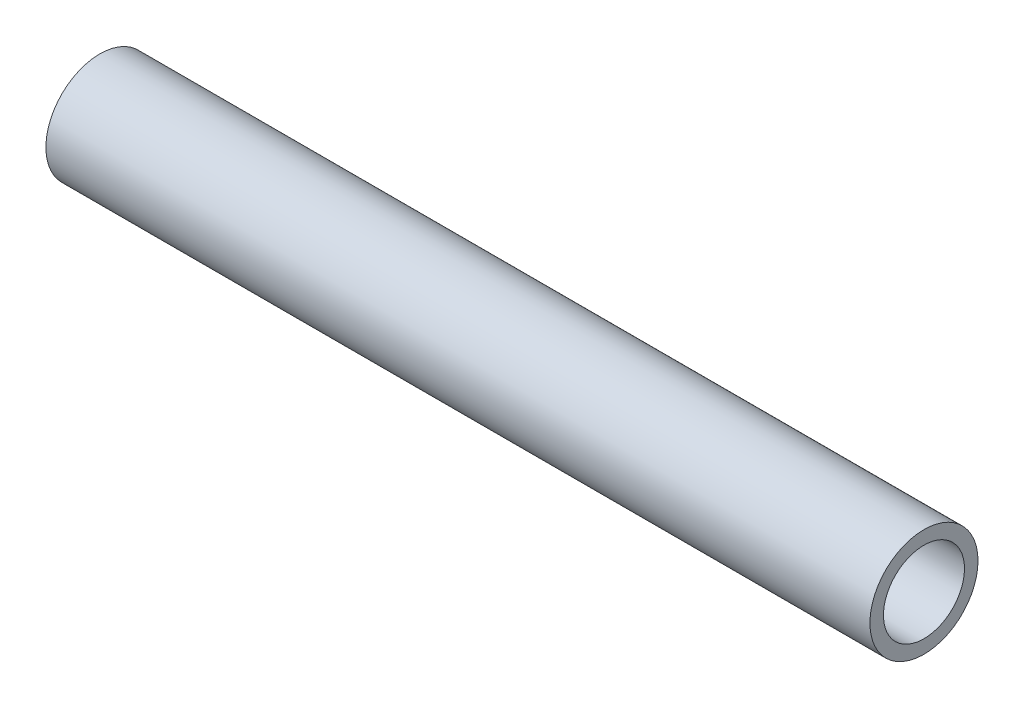
ISO-10303-21;
HEADER;
FILE_DESCRIPTION(('STEP AP214'),'2;1');
FILE_NAME('part.step','',(''),(''),'','','');
FILE_SCHEMA(('AUTOMOTIVE_DESIGN { 1 0 10303 214 1 1 1 1 }'));
ENDSEC;
DATA;
#1=APPLICATION_CONTEXT('core data for automotive mechanical design processes');
#2=APPLICATION_PROTOCOL_DEFINITION('international standard','automotive_design',2000,#1);
#3=PRODUCT_CONTEXT('',#1,'mechanical');
#4=PRODUCT('Part','Part','',(#3));
#5=PRODUCT_RELATED_PRODUCT_CATEGORY('part','',(#4));
#6=PRODUCT_DEFINITION_FORMATION('','',#4);
#7=PRODUCT_DEFINITION_CONTEXT('part definition',#1,'design');
#8=PRODUCT_DEFINITION('design','',#6,#7);
#9=PRODUCT_DEFINITION_SHAPE('','',#8);
#10=(LENGTH_UNIT() NAMED_UNIT(*) SI_UNIT(.MILLI.,.METRE.));
#11=(NAMED_UNIT(*) PLANE_ANGLE_UNIT() SI_UNIT($,.RADIAN.));
#12=(NAMED_UNIT(*) SI_UNIT($,.STERADIAN.) SOLID_ANGLE_UNIT());
#13=UNCERTAINTY_MEASURE_WITH_UNIT(LENGTH_MEASURE(1.E-05),#10,'distance_accuracy_value','');
#14=(GEOMETRIC_REPRESENTATION_CONTEXT(3) GLOBAL_UNCERTAINTY_ASSIGNED_CONTEXT((#13)) GLOBAL_UNIT_ASSIGNED_CONTEXT((#10,
#11,#12)) REPRESENTATION_CONTEXT('',''));
#15=CARTESIAN_POINT('',(0.,0.,0.));
#16=DIRECTION('',(0.,0.,1.));
#17=DIRECTION('',(1.,0.,0.));
#18=AXIS2_PLACEMENT_3D('',#15,#16,#17);
#19=CARTESIAN_POINT('',(193.675,0.,0.));
#20=DIRECTION('',(1.,0.,0.));
#21=DIRECTION('',(0.,0.,-1.));
#22=AXIS2_PLACEMENT_3D('',#19,#20,#21);
#23=PLANE('',#22);
#24=CARTESIAN_POINT('',(193.675,0.,0.));
#25=DIRECTION('',(1.,0.,0.));
#26=DIRECTION('',(0.,0.,-1.));
#27=AXIS2_PLACEMENT_3D('',#24,#25,#26);
#28=CIRCLE('',#27,12.7);
#29=CARTESIAN_POINT('',(193.675,0.,-12.7));
#30=VERTEX_POINT('',#29);
#31=EDGE_CURVE('E10',#30,#30,#28,.T.);
#32=ORIENTED_EDGE('',*,*,#31,.T.);
#33=EDGE_LOOP('',(#32));
#34=FACE_BOUND('',#33,.T.);
#35=CARTESIAN_POINT('',(193.675,0.,0.));
#36=DIRECTION('',(1.,0.,0.));
#37=DIRECTION('',(0.,0.,-1.));
#38=AXIS2_PLACEMENT_3D('',#35,#36,#37);
#39=CIRCLE('',#38,9.525);
#40=CARTESIAN_POINT('',(193.675,0.,-9.525));
#41=VERTEX_POINT('',#40);
#42=EDGE_CURVE('E50',#41,#41,#39,.T.);
#43=ORIENTED_EDGE('',*,*,#42,.F.);
#44=EDGE_LOOP('',(#43));
#45=FACE_BOUND('',#44,.T.);
#46=ADVANCED_FACE('F37',(#34,#45),#23,.T.);
#47=CARTESIAN_POINT('',(0.,0.,0.));
#48=DIRECTION('',(1.,0.,0.));
#49=DIRECTION('',(0.,0.,-1.));
#50=AXIS2_PLACEMENT_3D('',#47,#48,#49);
#51=PLANE('',#50);
#52=CARTESIAN_POINT('',(0.,0.,0.));
#53=DIRECTION('',(1.,0.,0.));
#54=DIRECTION('',(0.,0.,-1.));
#55=AXIS2_PLACEMENT_3D('',#52,#53,#54);
#56=CIRCLE('',#55,12.7);
#57=CARTESIAN_POINT('',(0.,0.,-12.7));
#58=VERTEX_POINT('',#57);
#59=EDGE_CURVE('E41',#58,#58,#56,.T.);
#60=ORIENTED_EDGE('',*,*,#59,.F.);
#61=EDGE_LOOP('',(#60));
#62=FACE_BOUND('',#61,.T.);
#63=CARTESIAN_POINT('',(0.,0.,0.));
#64=DIRECTION('',(1.,0.,0.));
#65=DIRECTION('',(0.,0.,-1.));
#66=AXIS2_PLACEMENT_3D('',#63,#64,#65);
#67=CIRCLE('',#66,9.525);
#68=CARTESIAN_POINT('',(0.,0.,-9.525));
#69=VERTEX_POINT('',#68);
#70=EDGE_CURVE('E52',#69,#69,#67,.T.);
#71=ORIENTED_EDGE('',*,*,#70,.T.);
#72=EDGE_LOOP('',(#71));
#73=FACE_BOUND('',#72,.T.);
#74=ADVANCED_FACE('F64',(#62,#73),#51,.F.);
#75=CARTESIAN_POINT('',(193.675,0.,0.));
#76=DIRECTION('',(-1.,0.,0.));
#77=DIRECTION('',(0.,0.,1.));
#78=AXIS2_PLACEMENT_3D('',#75,#76,#77);
#79=CYLINDRICAL_SURFACE('',#78,12.7);
#80=ORIENTED_EDGE('',*,*,#31,.F.);
#81=EDGE_LOOP('',(#80));
#82=FACE_BOUND('',#81,.T.);
#83=ORIENTED_EDGE('',*,*,#59,.T.);
#84=EDGE_LOOP('',(#83));
#85=FACE_BOUND('',#84,.T.);
#86=ADVANCED_FACE('F39',(#82,#85),#79,.T.);
#87=CARTESIAN_POINT('',(193.675,0.,0.));
#88=DIRECTION('',(-1.,0.,0.));
#89=DIRECTION('',(0.,0.,1.));
#90=AXIS2_PLACEMENT_3D('',#87,#88,#89);
#91=CYLINDRICAL_SURFACE('',#90,9.525);
#92=ORIENTED_EDGE('',*,*,#42,.T.);
#93=EDGE_LOOP('',(#92));
#94=FACE_BOUND('',#93,.T.);
#95=ORIENTED_EDGE('',*,*,#70,.F.);
#96=EDGE_LOOP('',(#95));
#97=FACE_BOUND('',#96,.T.);
#98=ADVANCED_FACE('F60',(#94,#97),#91,.F.);
#99=CLOSED_SHELL('',(#46,#74,#86,#98));
#100=MANIFOLD_SOLID_BREP('B2',#99);
#101=ADVANCED_BREP_SHAPE_REPRESENTATION('',(#18,#100),#14);
#102=SHAPE_DEFINITION_REPRESENTATION(#9,#101);
ENDSEC;
END-ISO-10303-21;
